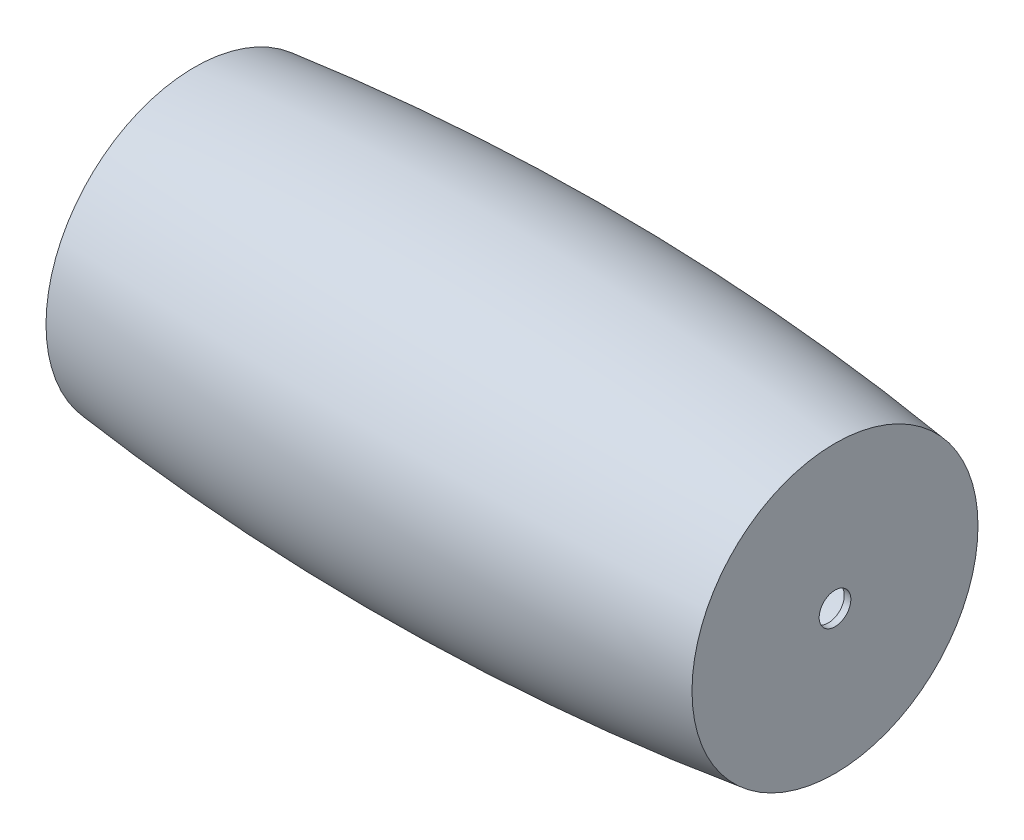
ISO-10303-21;
HEADER;
FILE_DESCRIPTION(('STEP AP214'),'2;1');
FILE_NAME('part.step','',(''),(''),'','','');
FILE_SCHEMA(('AUTOMOTIVE_DESIGN { 1 0 10303 214 1 1 1 1 }'));
ENDSEC;
DATA;
#1=APPLICATION_CONTEXT('core data for automotive mechanical design processes');
#2=APPLICATION_PROTOCOL_DEFINITION('international standard','automotive_design',2000,#1);
#3=PRODUCT_CONTEXT('',#1,'mechanical');
#4=PRODUCT('Part','Part','',(#3));
#5=PRODUCT_RELATED_PRODUCT_CATEGORY('part','',(#4));
#6=PRODUCT_DEFINITION_FORMATION('','',#4);
#7=PRODUCT_DEFINITION_CONTEXT('part definition',#1,'design');
#8=PRODUCT_DEFINITION('design','',#6,#7);
#9=PRODUCT_DEFINITION_SHAPE('','',#8);
#10=(LENGTH_UNIT() NAMED_UNIT(*) SI_UNIT(.MILLI.,.METRE.));
#11=(NAMED_UNIT(*) PLANE_ANGLE_UNIT() SI_UNIT($,.RADIAN.));
#12=(NAMED_UNIT(*) SI_UNIT($,.STERADIAN.) SOLID_ANGLE_UNIT());
#13=UNCERTAINTY_MEASURE_WITH_UNIT(LENGTH_MEASURE(1.E-05),#10,'distance_accuracy_value','');
#14=(GEOMETRIC_REPRESENTATION_CONTEXT(3) GLOBAL_UNCERTAINTY_ASSIGNED_CONTEXT((#13)) GLOBAL_UNIT_ASSIGNED_CONTEXT((#10,
#11,#12)) REPRESENTATION_CONTEXT('',''));
#15=CARTESIAN_POINT('',(0.,0.,0.));
#16=DIRECTION('',(0.,0.,1.));
#17=DIRECTION('',(1.,0.,0.));
#18=AXIS2_PLACEMENT_3D('',#15,#16,#17);
#19=CARTESIAN_POINT('',(450.,-193.017510099732,0.));
#20=DIRECTION('',(-1.,0.,0.));
#21=DIRECTION('',(0.,0.,1.));
#22=AXIS2_PLACEMENT_3D('',#19,#20,#21);
#23=DEGENERATE_TOROIDAL_SURFACE('',#22,3812.50000000001,4062.50000000001,.F.);
#24=CARTESIAN_POINT('',(0.,-193.017510099732,0.));
#25=DIRECTION('',(-1.,0.,0.));
#26=DIRECTION('',(0.,0.,1.));
#27=AXIS2_PLACEMENT_3D('',#24,#25,#26);
#28=CIRCLE('',#27,225.);
#29=CARTESIAN_POINT('',(0.,-193.017510099732,225.));
#30=VERTEX_POINT('',#29);
#31=EDGE_CURVE('E49',#30,#30,#28,.T.);
#32=ORIENTED_EDGE('',*,*,#31,.F.);
#33=EDGE_LOOP('',(#32));
#34=FACE_BOUND('',#33,.T.);
#35=CARTESIAN_POINT('',(970.,-193.017510099732,0.));
#36=DIRECTION('',(-1.,0.,0.));
#37=DIRECTION('',(0.,0.,1.));
#38=AXIS2_PLACEMENT_3D('',#35,#36,#37);
#39=CIRCLE('',#38,216.582556860805);
#40=CARTESIAN_POINT('',(970.,-193.017510099732,216.582556860805));
#41=VERTEX_POINT('',#40);
#42=EDGE_CURVE('E10',#41,#41,#39,.T.);
#43=ORIENTED_EDGE('',*,*,#42,.T.);
#44=EDGE_LOOP('',(#43));
#45=FACE_BOUND('',#44,.T.);
#46=ADVANCED_FACE('F33',(#34,#45),#23,.F.);
#47=CARTESIAN_POINT('',(970.,-193.017510099732,0.));
#48=DIRECTION('',(-1.,0.,0.));
#49=DIRECTION('',(0.,0.,1.));
#50=AXIS2_PLACEMENT_3D('',#47,#48,#49);
#51=PLANE('',#50);
#52=CARTESIAN_POINT('',(970.,-193.017510099731,0.));
#53=DIRECTION('',(-1.,0.,0.));
#54=DIRECTION('',(0.,-1.,0.));
#55=AXIS2_PLACEMENT_3D('',#52,#53,#54);
#56=CIRCLE('',#55,24.);
#57=CARTESIAN_POINT('',(970.,-217.017510099731,0.));
#58=VERTEX_POINT('',#57);
#59=EDGE_CURVE('E52',#58,#58,#56,.T.);
#60=ORIENTED_EDGE('',*,*,#59,.T.);
#61=EDGE_LOOP('',(#60));
#62=FACE_BOUND('',#61,.T.);
#63=ORIENTED_EDGE('',*,*,#42,.F.);
#64=EDGE_LOOP('',(#63));
#65=FACE_BOUND('',#64,.T.);
#66=ADVANCED_FACE('F74',(#62,#65),#51,.F.);
#67=CARTESIAN_POINT('',(960.,-193.017510099732,0.));
#68=DIRECTION('',(1.,0.,0.));
#69=DIRECTION('',(0.,0.,-1.));
#70=AXIS2_PLACEMENT_3D('',#67,#68,#69);
#71=PLANE('',#70);
#72=CARTESIAN_POINT('',(960.,-193.017510099731,0.));
#73=DIRECTION('',(1.,0.,0.));
#74=DIRECTION('',(0.,0.,-1.));
#75=AXIS2_PLACEMENT_3D('',#72,#73,#74);
#76=CIRCLE('',#75,24.);
#77=CARTESIAN_POINT('',(960.,-193.017510099731,-24.));
#78=VERTEX_POINT('',#77);
#79=EDGE_CURVE('E36',#78,#78,#76,.T.);
#80=ORIENTED_EDGE('',*,*,#79,.T.);
#81=EDGE_LOOP('',(#80));
#82=FACE_BOUND('',#81,.T.);
#83=CARTESIAN_POINT('',(960.,-193.017510099732,0.));
#84=DIRECTION('',(-1.,0.,0.));
#85=DIRECTION('',(0.,0.,1.));
#86=AXIS2_PLACEMENT_3D('',#83,#84,#85);
#87=CIRCLE('',#86,207.780618315095);
#88=CARTESIAN_POINT('',(960.,-193.017510099732,207.780618315095));
#89=VERTEX_POINT('',#88);
#90=EDGE_CURVE('E40',#89,#89,#87,.T.);
#91=ORIENTED_EDGE('',*,*,#90,.T.);
#92=EDGE_LOOP('',(#91));
#93=FACE_BOUND('',#92,.T.);
#94=ADVANCED_FACE('F59',(#82,#93),#71,.F.);
#95=CARTESIAN_POINT('',(450.,-193.017510099732,0.));
#96=DIRECTION('',(-1.,0.,0.));
#97=DIRECTION('',(0.,0.,1.));
#98=AXIS2_PLACEMENT_3D('',#95,#96,#97);
#99=DEGENERATE_TOROIDAL_SURFACE('',#98,3812.50000000001,4052.50000000001,.F.);
#100=ORIENTED_EDGE('',*,*,#90,.F.);
#101=EDGE_LOOP('',(#100));
#102=FACE_BOUND('',#101,.T.);
#103=CARTESIAN_POINT('',(0.,-193.017510099732,0.));
#104=DIRECTION('',(-1.,0.,0.));
#105=DIRECTION('',(0.,0.,1.));
#106=AXIS2_PLACEMENT_3D('',#103,#104,#105);
#107=CIRCLE('',#106,214.937926275215);
#108=CARTESIAN_POINT('',(0.,-193.017510099732,214.937926275215));
#109=VERTEX_POINT('',#108);
#110=EDGE_CURVE('E44',#109,#109,#107,.T.);
#111=ORIENTED_EDGE('',*,*,#110,.T.);
#112=EDGE_LOOP('',(#111));
#113=FACE_BOUND('',#112,.T.);
#114=ADVANCED_FACE('F70',(#102,#113),#99,.T.);
#115=CARTESIAN_POINT('',(0.,21.9204161754831,0.));
#116=DIRECTION('',(1.,0.,0.));
#117=DIRECTION('',(0.,0.,-1.));
#118=AXIS2_PLACEMENT_3D('',#115,#116,#117);
#119=PLANE('',#118);
#120=ORIENTED_EDGE('',*,*,#110,.F.);
#121=EDGE_LOOP('',(#120));
#122=FACE_BOUND('',#121,.T.);
#123=ORIENTED_EDGE('',*,*,#31,.T.);
#124=EDGE_LOOP('',(#123));
#125=FACE_BOUND('',#124,.T.);
#126=ADVANCED_FACE('F64',(#122,#125),#119,.F.);
#127=CARTESIAN_POINT('',(970.,-193.017510099731,0.));
#128=DIRECTION('',(-1.,0.,0.));
#129=DIRECTION('',(0.,-1.,0.));
#130=AXIS2_PLACEMENT_3D('',#127,#128,#129);
#131=CYLINDRICAL_SURFACE('',#130,24.);
#132=ORIENTED_EDGE('',*,*,#59,.F.);
#133=EDGE_LOOP('',(#132));
#134=FACE_BOUND('',#133,.T.);
#135=ORIENTED_EDGE('',*,*,#79,.F.);
#136=EDGE_LOOP('',(#135));
#137=FACE_BOUND('',#136,.T.);
#138=ADVANCED_FACE('F62',(#134,#137),#131,.F.);
#139=CLOSED_SHELL('',(#46,#66,#94,#114,#126,#138));
#140=MANIFOLD_SOLID_BREP('B2',#139);
#141=ADVANCED_BREP_SHAPE_REPRESENTATION('',(#18,#140),#14);
#142=SHAPE_DEFINITION_REPRESENTATION(#9,#141);
ENDSEC;
END-ISO-10303-21;
